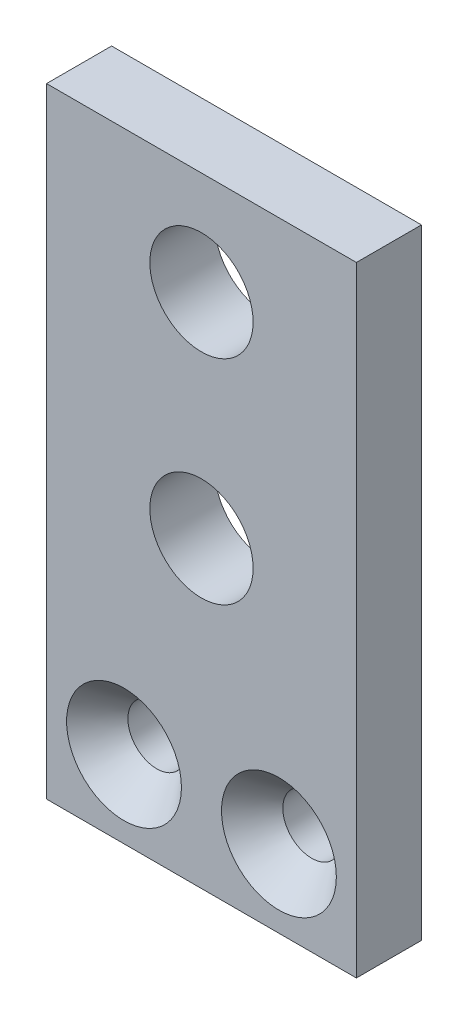
ISO-10303-21;
HEADER;
FILE_DESCRIPTION(('STEP AP214'),'2;1');
FILE_NAME('part.step','',(''),(''),'','','');
FILE_SCHEMA(('AUTOMOTIVE_DESIGN { 1 0 10303 214 1 1 1 1 }'));
ENDSEC;
DATA;
#1=APPLICATION_CONTEXT('core data for automotive mechanical design processes');
#2=APPLICATION_PROTOCOL_DEFINITION('international standard','automotive_design',2000,#1);
#3=PRODUCT_CONTEXT('',#1,'mechanical');
#4=PRODUCT('Part','Part','',(#3));
#5=PRODUCT_RELATED_PRODUCT_CATEGORY('part','',(#4));
#6=PRODUCT_DEFINITION_FORMATION('','',#4);
#7=PRODUCT_DEFINITION_CONTEXT('part definition',#1,'design');
#8=PRODUCT_DEFINITION('design','',#6,#7);
#9=PRODUCT_DEFINITION_SHAPE('','',#8);
#10=(LENGTH_UNIT() NAMED_UNIT(*) SI_UNIT(.MILLI.,.METRE.));
#11=(NAMED_UNIT(*) PLANE_ANGLE_UNIT() SI_UNIT($,.RADIAN.));
#12=(NAMED_UNIT(*) SI_UNIT($,.STERADIAN.) SOLID_ANGLE_UNIT());
#13=UNCERTAINTY_MEASURE_WITH_UNIT(LENGTH_MEASURE(1.E-05),#10,'distance_accuracy_value','');
#14=(GEOMETRIC_REPRESENTATION_CONTEXT(3) GLOBAL_UNCERTAINTY_ASSIGNED_CONTEXT((#13)) GLOBAL_UNIT_ASSIGNED_CONTEXT((#10,
#11,#12)) REPRESENTATION_CONTEXT('',''));
#15=CARTESIAN_POINT('',(0.,0.,0.));
#16=DIRECTION('',(0.,0.,1.));
#17=DIRECTION('',(1.,0.,0.));
#18=AXIS2_PLACEMENT_3D('',#15,#16,#17);
#19=CARTESIAN_POINT('',(4.7625,-9.525,2.));
#20=DIRECTION('',(-1.,0.,0.));
#21=DIRECTION('',(0.,0.,1.));
#22=AXIS2_PLACEMENT_3D('',#19,#20,#21);
#23=PLANE('',#22);
#24=DIRECTION('',(0.,1.,0.));
#25=VECTOR('',#24,1.);
#26=CARTESIAN_POINT('',(4.7625,-9.525,0.));
#27=LINE('',#26,#25);
#28=CARTESIAN_POINT('',(4.7625,-9.525,0.));
#29=VERTEX_POINT('',#28);
#30=CARTESIAN_POINT('',(4.7625,9.525,0.));
#31=VERTEX_POINT('',#30);
#32=EDGE_CURVE('E97',#29,#31,#27,.T.);
#33=ORIENTED_EDGE('',*,*,#32,.T.);
#34=DIRECTION('',(0.,0.,-1.));
#35=VECTOR('',#34,1.);
#36=CARTESIAN_POINT('',(4.7625,9.525,2.));
#37=LINE('',#36,#35);
#38=CARTESIAN_POINT('',(4.7625,9.525,2.));
#39=VERTEX_POINT('',#38);
#40=EDGE_CURVE('E11',#39,#31,#37,.T.);
#41=ORIENTED_EDGE('',*,*,#40,.F.);
#42=DIRECTION('',(0.,1.,0.));
#43=VECTOR('',#42,1.);
#44=CARTESIAN_POINT('',(4.7625,-9.525,2.));
#45=LINE('',#44,#43);
#46=CARTESIAN_POINT('',(4.7625,-9.525,2.));
#47=VERTEX_POINT('',#46);
#48=EDGE_CURVE('E84',#47,#39,#45,.T.);
#49=ORIENTED_EDGE('',*,*,#48,.F.);
#50=DIRECTION('',(0.,0.,-1.));
#51=VECTOR('',#50,1.);
#52=CARTESIAN_POINT('',(4.7625,-9.525,2.));
#53=LINE('',#52,#51);
#54=EDGE_CURVE('E93',#47,#29,#53,.T.);
#55=ORIENTED_EDGE('',*,*,#54,.T.);
#56=EDGE_LOOP('',(#33,#41,#49,#55));
#57=FACE_BOUND('',#56,.T.);
#58=ADVANCED_FACE('F32',(#57),#23,.F.);
#59=CARTESIAN_POINT('',(-4.7625,9.525,2.));
#60=DIRECTION('',(0.,-1.,0.));
#61=DIRECTION('',(0.,0.,-1.));
#62=AXIS2_PLACEMENT_3D('',#59,#60,#61);
#63=PLANE('',#62);
#64=DIRECTION('',(-1.,0.,0.));
#65=VECTOR('',#64,1.);
#66=CARTESIAN_POINT('',(-4.7625,9.525,0.));
#67=LINE('',#66,#65);
#68=CARTESIAN_POINT('',(-4.7625,9.525,0.));
#69=VERTEX_POINT('',#68);
#70=EDGE_CURVE('E88',#31,#69,#67,.T.);
#71=ORIENTED_EDGE('',*,*,#70,.T.);
#72=DIRECTION('',(0.,0.,-1.));
#73=VECTOR('',#72,1.);
#74=CARTESIAN_POINT('',(-4.7625,9.525,2.));
#75=LINE('',#74,#73);
#76=CARTESIAN_POINT('',(-4.7625,9.525,2.));
#77=VERTEX_POINT('',#76);
#78=EDGE_CURVE('E41',#77,#69,#75,.T.);
#79=ORIENTED_EDGE('',*,*,#78,.F.);
#80=DIRECTION('',(-1.,0.,0.));
#81=VECTOR('',#80,1.);
#82=CARTESIAN_POINT('',(-4.7625,9.525,2.));
#83=LINE('',#82,#81);
#84=EDGE_CURVE('E79',#39,#77,#83,.T.);
#85=ORIENTED_EDGE('',*,*,#84,.F.);
#86=ORIENTED_EDGE('',*,*,#40,.T.);
#87=EDGE_LOOP('',(#71,#79,#85,#86));
#88=FACE_BOUND('',#87,.T.);
#89=ADVANCED_FACE('F87',(#88),#63,.F.);
#90=CARTESIAN_POINT('',(-4.7625,-9.525,2.));
#91=DIRECTION('',(1.,0.,0.));
#92=DIRECTION('',(0.,0.,-1.));
#93=AXIS2_PLACEMENT_3D('',#90,#91,#92);
#94=PLANE('',#93);
#95=DIRECTION('',(0.,-1.,0.));
#96=VECTOR('',#95,1.);
#97=CARTESIAN_POINT('',(-4.7625,-9.525,0.));
#98=LINE('',#97,#96);
#99=CARTESIAN_POINT('',(-4.7625,-9.525,0.));
#100=VERTEX_POINT('',#99);
#101=EDGE_CURVE('E66',#69,#100,#98,.T.);
#102=ORIENTED_EDGE('',*,*,#101,.T.);
#103=DIRECTION('',(0.,0.,-1.));
#104=VECTOR('',#103,1.);
#105=CARTESIAN_POINT('',(-4.7625,-9.525,2.));
#106=LINE('',#105,#104);
#107=CARTESIAN_POINT('',(-4.7625,-9.525,2.));
#108=VERTEX_POINT('',#107);
#109=EDGE_CURVE('E89',#108,#100,#106,.T.);
#110=ORIENTED_EDGE('',*,*,#109,.F.);
#111=DIRECTION('',(0.,-1.,0.));
#112=VECTOR('',#111,1.);
#113=CARTESIAN_POINT('',(-4.7625,-9.525,2.));
#114=LINE('',#113,#112);
#115=EDGE_CURVE('E82',#77,#108,#114,.T.);
#116=ORIENTED_EDGE('',*,*,#115,.F.);
#117=ORIENTED_EDGE('',*,*,#78,.T.);
#118=EDGE_LOOP('',(#102,#110,#116,#117));
#119=FACE_BOUND('',#118,.T.);
#120=ADVANCED_FACE('F91',(#119),#94,.F.);
#121=CARTESIAN_POINT('',(-4.7625,-9.525,2.));
#122=DIRECTION('',(0.,1.,0.));
#123=DIRECTION('',(0.,0.,1.));
#124=AXIS2_PLACEMENT_3D('',#121,#122,#123);
#125=PLANE('',#124);
#126=DIRECTION('',(1.,0.,0.));
#127=VECTOR('',#126,1.);
#128=CARTESIAN_POINT('',(-4.7625,-9.525,0.));
#129=LINE('',#128,#127);
#130=EDGE_CURVE('E72',#100,#29,#129,.T.);
#131=ORIENTED_EDGE('',*,*,#130,.T.);
#132=ORIENTED_EDGE('',*,*,#54,.F.);
#133=DIRECTION('',(1.,0.,0.));
#134=VECTOR('',#133,1.);
#135=CARTESIAN_POINT('',(-4.7625,-9.525,2.));
#136=LINE('',#135,#134);
#137=EDGE_CURVE('E49',#108,#47,#136,.T.);
#138=ORIENTED_EDGE('',*,*,#137,.F.);
#139=ORIENTED_EDGE('',*,*,#109,.T.);
#140=EDGE_LOOP('',(#131,#132,#138,#139));
#141=FACE_BOUND('',#140,.T.);
#142=ADVANCED_FACE('F105',(#141),#125,.F.);
#143=CARTESIAN_POINT('',(4.76249999999999,9.525,2.));
#144=DIRECTION('',(0.,0.,-1.));
#145=DIRECTION('',(-1.,0.,0.));
#146=AXIS2_PLACEMENT_3D('',#143,#144,#145);
#147=PLANE('',#146);
#148=CARTESIAN_POINT('',(0.,6.35,2.));
#149=DIRECTION('',(0.,0.,1.));
#150=DIRECTION('',(1.,0.,0.));
#151=AXIS2_PLACEMENT_3D('',#148,#149,#150);
#152=CIRCLE('',#151,1.5875);
#153=CARTESIAN_POINT('',(1.5875,6.35,2.));
#154=VERTEX_POINT('',#153);
#155=EDGE_CURVE('E134',#154,#154,#152,.T.);
#156=ORIENTED_EDGE('',*,*,#155,.F.);
#157=EDGE_LOOP('',(#156));
#158=FACE_BOUND('',#157,.T.);
#159=CARTESIAN_POINT('',(0.,-0.203200000000002,2.));
#160=DIRECTION('',(0.,0.,1.));
#161=DIRECTION('',(1.,0.,0.));
#162=AXIS2_PLACEMENT_3D('',#159,#160,#161);
#163=CIRCLE('',#162,1.5875);
#164=CARTESIAN_POINT('',(1.5875,-0.203200000000002,2.));
#165=VERTEX_POINT('',#164);
#166=EDGE_CURVE('E131',#165,#165,#163,.T.);
#167=ORIENTED_EDGE('',*,*,#166,.F.);
#168=EDGE_LOOP('',(#167));
#169=FACE_BOUND('',#168,.T.);
#170=CARTESIAN_POINT('',(-2.38125,-7.14375,2.));
#171=DIRECTION('',(0.,0.,1.));
#172=DIRECTION('',(1.,0.,0.));
#173=AXIS2_PLACEMENT_3D('',#170,#171,#172);
#174=CIRCLE('',#173,1.7653);
#175=CARTESIAN_POINT('',(-0.615950000000002,-7.14375,2.));
#176=VERTEX_POINT('',#175);
#177=EDGE_CURVE('E125',#176,#176,#174,.T.);
#178=ORIENTED_EDGE('',*,*,#177,.F.);
#179=EDGE_LOOP('',(#178));
#180=FACE_BOUND('',#179,.T.);
#181=CARTESIAN_POINT('',(2.38125,-7.14375,2.));
#182=DIRECTION('',(0.,0.,1.));
#183=DIRECTION('',(1.,0.,0.));
#184=AXIS2_PLACEMENT_3D('',#181,#182,#183);
#185=CIRCLE('',#184,1.7653);
#186=CARTESIAN_POINT('',(4.14655,-7.14375,2.));
#187=VERTEX_POINT('',#186);
#188=EDGE_CURVE('E116',#187,#187,#185,.T.);
#189=ORIENTED_EDGE('',*,*,#188,.F.);
#190=EDGE_LOOP('',(#189));
#191=FACE_BOUND('',#190,.T.);
#192=ORIENTED_EDGE('',*,*,#48,.T.);
#193=ORIENTED_EDGE('',*,*,#84,.T.);
#194=ORIENTED_EDGE('',*,*,#115,.T.);
#195=ORIENTED_EDGE('',*,*,#137,.T.);
#196=EDGE_LOOP('',(#192,#193,#194,#195));
#197=FACE_BOUND('',#196,.T.);
#198=ADVANCED_FACE('F80',(#158,#169,#180,#191,#197),#147,.F.);
#199=CARTESIAN_POINT('',(4.76249999999999,9.525,0.));
#200=DIRECTION('',(0.,0.,-1.));
#201=DIRECTION('',(-1.,0.,0.));
#202=AXIS2_PLACEMENT_3D('',#199,#200,#201);
#203=PLANE('',#202);
#204=CARTESIAN_POINT('',(0.,6.35,0.));
#205=DIRECTION('',(0.,0.,-1.));
#206=DIRECTION('',(-1.,0.,0.));
#207=AXIS2_PLACEMENT_3D('',#204,#205,#206);
#208=CIRCLE('',#207,1.5875);
#209=CARTESIAN_POINT('',(-1.5875,6.35,0.));
#210=VERTEX_POINT('',#209);
#211=EDGE_CURVE('E35',#210,#210,#208,.T.);
#212=ORIENTED_EDGE('',*,*,#211,.F.);
#213=EDGE_LOOP('',(#212));
#214=FACE_BOUND('',#213,.T.);
#215=CARTESIAN_POINT('',(0.,-0.203200000000002,0.));
#216=DIRECTION('',(0.,0.,-1.));
#217=DIRECTION('',(-1.,0.,0.));
#218=AXIS2_PLACEMENT_3D('',#215,#216,#217);
#219=CIRCLE('',#218,1.5875);
#220=CARTESIAN_POINT('',(-1.5875,-0.203200000000002,0.));
#221=VERTEX_POINT('',#220);
#222=EDGE_CURVE('E128',#221,#221,#219,.T.);
#223=ORIENTED_EDGE('',*,*,#222,.F.);
#224=EDGE_LOOP('',(#223));
#225=FACE_BOUND('',#224,.T.);
#226=CARTESIAN_POINT('',(-2.38125,-7.14375,0.));
#227=DIRECTION('',(0.,0.,1.));
#228=DIRECTION('',(1.,0.,0.));
#229=AXIS2_PLACEMENT_3D('',#226,#227,#228);
#230=CIRCLE('',#229,0.889);
#231=CARTESIAN_POINT('',(-1.49225,-7.14375,0.));
#232=VERTEX_POINT('',#231);
#233=EDGE_CURVE('E119',#232,#232,#230,.T.);
#234=ORIENTED_EDGE('',*,*,#233,.T.);
#235=EDGE_LOOP('',(#234));
#236=FACE_BOUND('',#235,.T.);
#237=CARTESIAN_POINT('',(2.38125,-7.14375,0.));
#238=DIRECTION('',(0.,0.,1.));
#239=DIRECTION('',(1.,0.,0.));
#240=AXIS2_PLACEMENT_3D('',#237,#238,#239);
#241=CIRCLE('',#240,0.889);
#242=CARTESIAN_POINT('',(3.27025,-7.14375,0.));
#243=VERTEX_POINT('',#242);
#244=EDGE_CURVE('E100',#243,#243,#241,.T.);
#245=ORIENTED_EDGE('',*,*,#244,.T.);
#246=EDGE_LOOP('',(#245));
#247=FACE_BOUND('',#246,.T.);
#248=ORIENTED_EDGE('',*,*,#32,.F.);
#249=ORIENTED_EDGE('',*,*,#130,.F.);
#250=ORIENTED_EDGE('',*,*,#101,.F.);
#251=ORIENTED_EDGE('',*,*,#70,.F.);
#252=EDGE_LOOP('',(#248,#249,#250,#251));
#253=FACE_BOUND('',#252,.T.);
#254=ADVANCED_FACE('F108',(#214,#225,#236,#247,#253),#203,.T.);
#255=CARTESIAN_POINT('',(2.38125,-7.14375,2.));
#256=DIRECTION('',(0.,0.,1.));
#257=DIRECTION('',(1.,0.,0.));
#258=AXIS2_PLACEMENT_3D('',#255,#256,#257);
#259=CYLINDRICAL_SURFACE('',#258,0.889);
#260=ORIENTED_EDGE('',*,*,#244,.F.);
#261=EDGE_LOOP('',(#260));
#262=FACE_BOUND('',#261,.T.);
#263=CARTESIAN_POINT('',(2.38125,-7.14375,0.991932164752229));
#264=DIRECTION('',(0.,0.,1.));
#265=DIRECTION('',(1.,0.,0.));
#266=AXIS2_PLACEMENT_3D('',#263,#264,#265);
#267=CIRCLE('',#266,0.889);
#268=CARTESIAN_POINT('',(3.27025,-7.14375,0.991932164752229));
#269=VERTEX_POINT('',#268);
#270=EDGE_CURVE('E113',#269,#269,#267,.T.);
#271=ORIENTED_EDGE('',*,*,#270,.T.);
#272=EDGE_LOOP('',(#271));
#273=FACE_BOUND('',#272,.T.);
#274=ADVANCED_FACE('F145',(#262,#273),#259,.F.);
#275=CARTESIAN_POINT('',(2.38125,-7.14375,2.));
#276=DIRECTION('',(0.,0.,1.));
#277=DIRECTION('',(1.,0.,0.));
#278=AXIS2_PLACEMENT_3D('',#275,#276,#277);
#279=CONICAL_SURFACE('',#278,1.7653,0.715584993317676);
#280=ORIENTED_EDGE('',*,*,#270,.F.);
#281=EDGE_LOOP('',(#280));
#282=FACE_BOUND('',#281,.T.);
#283=ORIENTED_EDGE('',*,*,#188,.T.);
#284=EDGE_LOOP('',(#283));
#285=FACE_BOUND('',#284,.T.);
#286=ADVANCED_FACE('F155',(#282,#285),#279,.F.);
#287=CARTESIAN_POINT('',(-2.38125,-7.14375,2.));
#288=DIRECTION('',(0.,0.,1.));
#289=DIRECTION('',(1.,0.,0.));
#290=AXIS2_PLACEMENT_3D('',#287,#288,#289);
#291=CYLINDRICAL_SURFACE('',#290,0.889);
#292=ORIENTED_EDGE('',*,*,#233,.F.);
#293=EDGE_LOOP('',(#292));
#294=FACE_BOUND('',#293,.T.);
#295=CARTESIAN_POINT('',(-2.38125,-7.14375,0.991932164752229));
#296=DIRECTION('',(0.,0.,1.));
#297=DIRECTION('',(1.,0.,0.));
#298=AXIS2_PLACEMENT_3D('',#295,#296,#297);
#299=CIRCLE('',#298,0.889);
#300=CARTESIAN_POINT('',(-1.49225,-7.14375,0.991932164752229));
#301=VERTEX_POINT('',#300);
#302=EDGE_CURVE('E122',#301,#301,#299,.T.);
#303=ORIENTED_EDGE('',*,*,#302,.T.);
#304=EDGE_LOOP('',(#303));
#305=FACE_BOUND('',#304,.T.);
#306=ADVANCED_FACE('F161',(#294,#305),#291,.F.);
#307=CARTESIAN_POINT('',(-2.38125,-7.14375,2.));
#308=DIRECTION('',(0.,0.,1.));
#309=DIRECTION('',(1.,0.,0.));
#310=AXIS2_PLACEMENT_3D('',#307,#308,#309);
#311=CONICAL_SURFACE('',#310,1.7653,0.715584993317675);
#312=ORIENTED_EDGE('',*,*,#302,.F.);
#313=EDGE_LOOP('',(#312));
#314=FACE_BOUND('',#313,.T.);
#315=ORIENTED_EDGE('',*,*,#177,.T.);
#316=EDGE_LOOP('',(#315));
#317=FACE_BOUND('',#316,.T.);
#318=ADVANCED_FACE('F210',(#314,#317),#311,.F.);
#319=CARTESIAN_POINT('',(0.,-0.203200000000002,2.));
#320=DIRECTION('',(0.,0.,1.));
#321=DIRECTION('',(1.,0.,0.));
#322=AXIS2_PLACEMENT_3D('',#319,#320,#321);
#323=CYLINDRICAL_SURFACE('',#322,1.5875);
#324=ORIENTED_EDGE('',*,*,#222,.T.);
#325=EDGE_LOOP('',(#324));
#326=FACE_BOUND('',#325,.T.);
#327=ORIENTED_EDGE('',*,*,#166,.T.);
#328=EDGE_LOOP('',(#327));
#329=FACE_BOUND('',#328,.T.);
#330=ADVANCED_FACE('F219',(#326,#329),#323,.F.);
#331=CARTESIAN_POINT('',(0.,6.35,2.));
#332=DIRECTION('',(0.,0.,1.));
#333=DIRECTION('',(1.,0.,0.));
#334=AXIS2_PLACEMENT_3D('',#331,#332,#333);
#335=CYLINDRICAL_SURFACE('',#334,1.5875);
#336=ORIENTED_EDGE('',*,*,#211,.T.);
#337=EDGE_LOOP('',(#336));
#338=FACE_BOUND('',#337,.T.);
#339=ORIENTED_EDGE('',*,*,#155,.T.);
#340=EDGE_LOOP('',(#339));
#341=FACE_BOUND('',#340,.T.);
#342=ADVANCED_FACE('F141',(#338,#341),#335,.F.);
#343=CLOSED_SHELL('',(#58,#89,#120,#142,#198,#254,#274,#286,#306,#318,#330,#342));
#344=MANIFOLD_SOLID_BREP('B2',#343);
#345=ADVANCED_BREP_SHAPE_REPRESENTATION('',(#18,#344),#14);
#346=SHAPE_DEFINITION_REPRESENTATION(#9,#345);
ENDSEC;
END-ISO-10303-21;
